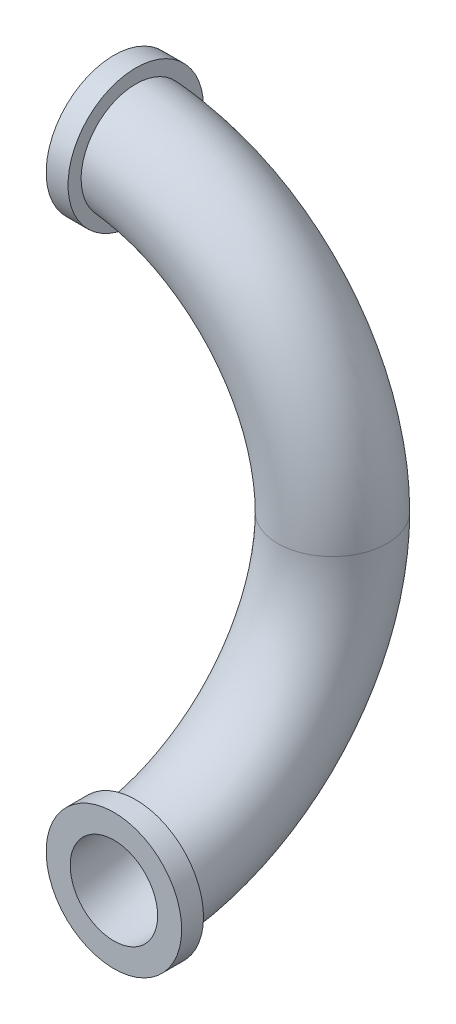
ISO-10303-21;
HEADER;
FILE_DESCRIPTION(('STEP AP214'),'2;1');
FILE_NAME('part.step','',(''),(''),'','','');
FILE_SCHEMA(('AUTOMOTIVE_DESIGN { 1 0 10303 214 1 1 1 1 }'));
ENDSEC;
DATA;
#1=APPLICATION_CONTEXT('core data for automotive mechanical design processes');
#2=APPLICATION_PROTOCOL_DEFINITION('international standard','automotive_design',2000,#1);
#3=PRODUCT_CONTEXT('',#1,'mechanical');
#4=PRODUCT('Part','Part','',(#3));
#5=PRODUCT_RELATED_PRODUCT_CATEGORY('part','',(#4));
#6=PRODUCT_DEFINITION_FORMATION('','',#4);
#7=PRODUCT_DEFINITION_CONTEXT('part definition',#1,'design');
#8=PRODUCT_DEFINITION('design','',#6,#7);
#9=PRODUCT_DEFINITION_SHAPE('','',#8);
#10=(LENGTH_UNIT() NAMED_UNIT(*) SI_UNIT(.MILLI.,.METRE.));
#11=(NAMED_UNIT(*) PLANE_ANGLE_UNIT() SI_UNIT($,.RADIAN.));
#12=(NAMED_UNIT(*) SI_UNIT($,.STERADIAN.) SOLID_ANGLE_UNIT());
#13=UNCERTAINTY_MEASURE_WITH_UNIT(LENGTH_MEASURE(1.E-05),#10,'distance_accuracy_value','');
#14=(GEOMETRIC_REPRESENTATION_CONTEXT(3) GLOBAL_UNCERTAINTY_ASSIGNED_CONTEXT((#13)) GLOBAL_UNIT_ASSIGNED_CONTEXT((#10,
#11,#12)) REPRESENTATION_CONTEXT('',''));
#15=CARTESIAN_POINT('',(0.,0.,0.));
#16=DIRECTION('',(0.,0.,1.));
#17=DIRECTION('',(1.,0.,0.));
#18=AXIS2_PLACEMENT_3D('',#15,#16,#17);
#19=CARTESIAN_POINT('',(0.,0.,1.));
#20=DIRECTION('',(-1.,0.,0.));
#21=DIRECTION('',(0.,0.,1.));
#22=AXIS2_PLACEMENT_3D('',#19,#20,#21);
#23=TOROIDAL_SURFACE('',#22,1.,0.25);
#24=CARTESIAN_POINT('',(0.,0.,0.));
#25=DIRECTION('',(0.,1.,0.));
#26=DIRECTION('',(0.,0.,1.));
#27=AXIS2_PLACEMENT_3D('',#24,#25,#26);
#28=CIRCLE('',#27,0.25);
#29=CARTESIAN_POINT('',(0.,0.,0.25));
#30=VERTEX_POINT('',#29);
#31=EDGE_CURVE('E10',#30,#30,#28,.F.);
#32=ORIENTED_EDGE('',*,*,#31,.T.);
#33=EDGE_LOOP('',(#32));
#34=FACE_BOUND('',#33,.T.);
#35=CARTESIAN_POINT('',(-0.178292636183617,-1.17098549054282,0.900000000000003));
#36=CARTESIAN_POINT('',(-0.1881607781353,-1.16090842808678,0.900000000000003));
#37=CARTESIAN_POINT('',(-0.197182692884507,-1.14998793195382,0.900000000000003));
#38=CARTESIAN_POINT('',(-0.213270077900997,-1.12677655508398,0.900000000000003));
#39=CARTESIAN_POINT('',(-0.22033309163346,-1.11448398054544,0.900000000000003));
#40=CARTESIAN_POINT('',(-0.232292866689927,-1.08889529204329,0.900000000000003));
#41=CARTESIAN_POINT('',(-0.237191034372383,-1.07559983617821,0.900000000000003));
#42=CARTESIAN_POINT('',(-0.244691584370048,-1.04838060332081,0.900000000000003));
#43=CARTESIAN_POINT('',(-0.247294534086588,-1.03445698251246,0.900000000000003));
#44=CARTESIAN_POINT('',(-0.250142452436041,-1.00632759492755,0.900000000000003));
#45=CARTESIAN_POINT('',(-0.250380189229146,-0.992121095819662,0.900000000000003));
#46=CARTESIAN_POINT('',(-0.248475214285631,-0.963867966938748,0.900000000000003));
#47=CARTESIAN_POINT('',(-0.246332355081699,-0.949821347123993,0.900000000000003));
#48=CARTESIAN_POINT('',(-0.239717413502975,-0.922241186252228,0.900000000000003));
#49=CARTESIAN_POINT('',(-0.235238091078439,-0.908709381110785,0.900000000000003));
#50=CARTESIAN_POINT('',(-0.224071976569553,-0.882589211894277,0.900000000000003));
#51=CARTESIAN_POINT('',(-0.217385165094366,-0.87000085610777,0.900000000000003));
#52=CARTESIAN_POINT('',(-0.201988642520699,-0.846124098833437,0.900000000000003));
#53=CARTESIAN_POINT('',(-0.193278440918038,-0.834836013547421,0.900000000000003));
#54=CARTESIAN_POINT('',(-0.17407922894507,-0.813889939376688,0.900000000000003));
#55=CARTESIAN_POINT('',(-0.163590251964975,-0.804231919900042,0.900000000000003));
#56=CARTESIAN_POINT('',(-0.141176479164212,-0.786867241939183,0.900000000000003));
#57=CARTESIAN_POINT('',(-0.129257971249421,-0.779152469253919,0.900000000000003));
#58=CARTESIAN_POINT('',(-0.104287031962781,-0.765851473076845,0.900000000000003));
#59=CARTESIAN_POINT('',(-0.0912346526586706,-0.76026515190924,0.900000000000003));
#60=CARTESIAN_POINT('',(-0.0644742428118953,-0.751425460421924,0.900000000000003));
#61=CARTESIAN_POINT('',(-0.050772048519749,-0.748154421249714,0.900000000000003));
#62=CARTESIAN_POINT('',(-0.023012077929381,-0.743975651296628,0.900000000000003));
#63=CARTESIAN_POINT('',(-0.00895431749171269,-0.743067815288643,0.900000000000003));
#64=CARTESIAN_POINT('',(0.0190228492591987,-0.74364135058969,0.900000000000003));
#65=CARTESIAN_POINT('',(0.0329425678616444,-0.745107621808641,0.900000000000003));
#66=CARTESIAN_POINT('',(0.0603380179178707,-0.750356198928883,0.900000000000003));
#67=CARTESIAN_POINT('',(0.073813751350267,-0.754138494507361,0.900000000000003));
#68=CARTESIAN_POINT('',(0.0999438190310865,-0.763906156922004,0.900000000000003));
#69=CARTESIAN_POINT('',(0.112598007726036,-0.769891912900078,0.900000000000003));
#70=CARTESIAN_POINT('',(0.136730876432484,-0.783889666200691,0.900000000000003));
#71=CARTESIAN_POINT('',(0.148209518516286,-0.791901728870833,0.900000000000003));
#72=CARTESIAN_POINT('',(0.169746255988988,-0.809778700852076,0.900000000000003));
#73=CARTESIAN_POINT('',(0.179794652113536,-0.81965529369633,0.900000000000003));
#74=CARTESIAN_POINT('',(0.19810623248561,-0.840943976249636,0.900000000000003));
#75=CARTESIAN_POINT('',(0.20636934276824,-0.852356129545618,0.900000000000003));
#76=CARTESIAN_POINT('',(0.220940331071125,-0.876486355486264,0.900000000000003));
#77=CARTESIAN_POINT('',(0.227232825912157,-0.889213719053285,0.900000000000003));
#78=CARTESIAN_POINT('',(0.237602040803077,-0.91554122766997,0.900000000000003));
#79=CARTESIAN_POINT('',(0.241678703230035,-0.929141395406706,0.900000000000003));
#80=CARTESIAN_POINT('',(0.247514080437859,-0.956889464003895,0.900000000000003));
#81=CARTESIAN_POINT('',(0.249263112362012,-0.971039402463742,0.900000000000003));
#82=CARTESIAN_POINT('',(0.250360209116889,-0.999432198204243,0.900000000000003));
#83=CARTESIAN_POINT('',(0.249708265447999,-1.01367505581366,0.900000000000003));
#84=CARTESIAN_POINT('',(0.246018978923066,-1.04184448636228,0.900000000000003));
#85=CARTESIAN_POINT('',(0.242982318470242,-1.05577114861014,0.900000000000003));
#86=CARTESIAN_POINT('',(0.234606556433797,-1.08291410811893,0.900000000000003));
#87=CARTESIAN_POINT('',(0.229267489324382,-1.09613041601276,0.900000000000003));
#88=CARTESIAN_POINT('',(0.21645555868548,-1.12143232220934,0.900000000000003));
#89=CARTESIAN_POINT('',(0.208989494520124,-1.1335213631535,0.900000000000003));
#90=CARTESIAN_POINT('',(0.192125980388275,-1.15626771424003,0.900000000000003));
#91=CARTESIAN_POINT('',(0.182728567012736,-1.16692505150084,0.900000000000003));
#92=CARTESIAN_POINT('',(0.162310005604278,-1.18645975330621,0.900000000000003));
#93=CARTESIAN_POINT('',(0.151295570919789,-1.19534413507507,0.900000000000003));
#94=CARTESIAN_POINT('',(0.127927087453048,-1.21112992028928,0.900000000000003));
#95=CARTESIAN_POINT('',(0.115573062265724,-1.21803135865347,0.900000000000003));
#96=CARTESIAN_POINT('',(0.0899224071837983,-1.22963088974639,0.900000000000003));
#97=CARTESIAN_POINT('',(0.0766291957724238,-1.23433654266105,0.900000000000003));
#98=CARTESIAN_POINT('',(0.0494410215956045,-1.24144365913665,0.900000000000003));
#99=CARTESIAN_POINT('',(0.0355460909861572,-1.24384524566895,0.900000000000003));
#100=CARTESIAN_POINT('',(0.00758219264240244,-1.24627239605983,0.900000000000003));
#101=CARTESIAN_POINT('',(-0.00648630877070629,-1.24630333770059,0.900000000000003));
#102=CARTESIAN_POINT('',(-0.0344323772539546,-1.24400127304341,0.900000000000003));
#103=CARTESIAN_POINT('',(-0.0483098967728788,-1.24166768843868,0.900000000000003));
#104=CARTESIAN_POINT('',(-0.0754744153645764,-1.23470428803997,0.900000000000003));
#105=CARTESIAN_POINT('',(-0.0887614308145444,-1.23007453597187,0.900000000000003));
#106=CARTESIAN_POINT('',(-0.114358765464973,-1.21865465943775,0.900000000000003));
#107=CARTESIAN_POINT('',(-0.126670245369808,-1.21186715201986,0.900000000000003));
#108=CARTESIAN_POINT('',(-0.145533828532969,-1.19929605354006,0.900000000000003));
#109=CARTESIAN_POINT('',(-0.152494362008292,-1.1941138072033,0.900000000000003));
#110=CARTESIAN_POINT('',(-0.165840730528643,-1.18305577365907,0.900000000000003));
#111=CARTESIAN_POINT('',(-0.172226565912627,-1.17717998686064,0.900000000000003));
#112=CARTESIAN_POINT('',(-0.178292636183617,-1.17098549054282,0.900000000000003));
#113=B_SPLINE_CURVE_WITH_KNOTS('',3,(#35,#36,#37,#38,#39,#40,#41,#42,#43,#44,#45,#46,#47,#48,
#49,#50,#51,#52,#53,#54,#55,#56,#57,#58,#59,#60,#61,#62,#63,#64,#65,#66,#67,#68,#69,#70,#71,#72,
#73,#74,#75,#76,#77,#78,#79,#80,#81,#82,#83,#84,#85,#86,#87,#88,#89,#90,#91,#92,#93,#94,#95,#96,
#97,#98,#99,#100,#101,#102,#103,#104,#105,#106,#107,#108,#109,#110,#111,#112),.UNSPECIFIED.,.T.,
.F.,(4,2,2,2,2,2,2,2,2,2,2,2,2,2,2,2,2,2,2,2,2,2,2,2,2,2,2,2,2,2,2,2,2,2,2,2,2,2,4),(0.,
0.0422806841704309,0.0846141525906926,0.126920079165117,0.169215544347814,0.211640291915797,
0.254067667654334,0.296627301989538,0.339187310183432,0.381757646433651,0.424327183664881,
0.466715905920491,0.509102682700278,0.551162395665215,0.59322023579173,0.635011623666279,
0.676802825272704,0.718601410953791,0.760401344794948,0.802472465255508,0.844545328400345,
0.886938878074265,0.92933353014368,0.971903996782705,1.01447461412419,1.05703305402574,
1.09959085671686,1.14201411286897,1.1844365653527,1.22668762914184,1.26893794886109,
1.31104170552296,1.3531432149214,1.39514921466858,1.43716549056303,1.47918060043894,
1.52114494518385,1.54713542584479,1.57312589117647),.UNSPECIFIED.);
#114=CARTESIAN_POINT('',(-0.178292636183617,-1.17098549054282,0.900000000000003));
#115=VERTEX_POINT('',#114);
#116=EDGE_CURVE('E49',#115,#115,#113,.T.);
#117=ORIENTED_EDGE('',*,*,#116,.T.);
#118=EDGE_LOOP('',(#117));
#119=FACE_BOUND('',#118,.T.);
#120=ADVANCED_FACE('F30',(#34,#119),#23,.T.);
#121=CARTESIAN_POINT('',(-1.,0.,0.));
#122=DIRECTION('',(0.,0.,1.));
#123=DIRECTION('',(1.,0.,0.));
#124=AXIS2_PLACEMENT_3D('',#121,#122,#123);
#125=TOROIDAL_SURFACE('',#124,1.,0.25);
#126=CARTESIAN_POINT('',(-0.900000000000003,0.798598903682392,-0.156239637939055));
#127=CARTESIAN_POINT('',(-0.900000000000003,0.807484618255236,-0.167252077609579));
#128=CARTESIAN_POINT('',(-0.900000000000003,0.817311544826018,-0.177518916216291));
#129=CARTESIAN_POINT('',(-0.900000000000003,0.838559793603693,-0.196263733860563));
#130=CARTESIAN_POINT('',(-0.900000000000003,0.849983168244315,-0.204739374280309));
#131=CARTESIAN_POINT('',(-0.900000000000003,0.874081969106657,-0.21965059164289));
#132=CARTESIAN_POINT('',(-0.900000000000003,0.886756519343002,-0.226087582802604));
#133=CARTESIAN_POINT('',(-0.900000000000003,0.91300023448786,-0.236747922206686));
#134=CARTESIAN_POINT('',(-0.900000000000003,0.926569163740225,-0.240971850957424));
#135=CARTESIAN_POINT('',(-0.900000000000003,0.954266098089081,-0.247100376432861));
#136=CARTESIAN_POINT('',(-0.900000000000003,0.968395725822489,-0.248997644239264));
#137=CARTESIAN_POINT('',(-0.900000000000003,0.996773707944956,-0.25039290443244));
#138=CARTESIAN_POINT('',(-0.900000000000003,1.01102206788375,-0.249890784032819));
#139=CARTESIAN_POINT('',(-0.900000000000003,1.03922913334701,-0.246498215551317));
#140=CARTESIAN_POINT('',(-0.900000000000003,1.0531878915475,-0.243608205779841));
#141=CARTESIAN_POINT('',(-0.900000000000003,1.08041932555232,-0.235518387044002));
#142=CARTESIAN_POINT('',(-0.900000000000003,1.09369201220856,-0.230318614626673));
#143=CARTESIAN_POINT('',(-0.900000000000003,1.11913001861259,-0.2177730971395));
#144=CARTESIAN_POINT('',(-0.900000000000003,1.13129864492456,-0.210434057268884));
#145=CARTESIAN_POINT('',(-0.900000000000003,1.15422440361082,-0.19380938875738));
#146=CARTESIAN_POINT('',(-0.900000000000003,1.16498156794405,-0.184523804203367));
#147=CARTESIAN_POINT('',(-0.900000000000003,1.18473296660521,-0.164309957154078));
#148=CARTESIAN_POINT('',(-0.900000000000003,1.19373414042714,-0.153388475286226));
#149=CARTESIAN_POINT('',(-0.900000000000003,1.20976742880129,-0.130184858647995));
#150=CARTESIAN_POINT('',(-0.900000000000003,1.2167995799634,-0.117902749181585));
#151=CARTESIAN_POINT('',(-0.900000000000003,1.22866989147601,-0.0923732303855616));
#152=CARTESIAN_POINT('',(-0.900000000000003,1.23351568693935,-0.0791293707956552));
#153=CARTESIAN_POINT('',(-0.900000000000003,1.24090948117469,-0.0520150874536931));
#154=CARTESIAN_POINT('',(-0.900000000000003,1.24345751315272,-0.0381446727593144));
#155=CARTESIAN_POINT('',(-0.900000000000003,1.24617903253143,-0.0102038849674368));
#156=CARTESIAN_POINT('',(-0.900000000000003,1.24635775803878,0.00386597816705005));
#157=CARTESIAN_POINT('',(-0.900000000000003,1.2443490557881,0.0318357092211724));
#158=CARTESIAN_POINT('',(-0.900000000000003,1.24216164206245,0.0457355781484645));
#159=CARTESIAN_POINT('',(-0.900000000000003,1.23548566564956,0.0729628531749478));
#160=CARTESIAN_POINT('',(-0.900000000000003,1.23099839651049,0.0862905765141687));
#161=CARTESIAN_POINT('',(-0.900000000000003,1.21985250641525,0.112004722408348));
#162=CARTESIAN_POINT('',(-0.900000000000003,1.2131938798134,0.124391142515752));
#163=CARTESIAN_POINT('',(-0.900000000000003,1.19788731542389,0.147887218294668));
#164=CARTESIAN_POINT('',(-0.900000000000003,1.18923708938565,0.158995383124042));
#165=CARTESIAN_POINT('',(-0.900000000000003,1.17019911655826,0.179606640126357));
#166=CARTESIAN_POINT('',(-0.900000000000003,1.15981135014478,0.189109714168458));
#167=CARTESIAN_POINT('',(-0.900000000000003,1.13756371948689,0.206269460174094));
#168=CARTESIAN_POINT('',(-0.900000000000003,1.1256999380033,0.213921053042685));
#169=CARTESIAN_POINT('',(-0.900000000000003,1.1008600065118,0.227132541762657));
#170=CARTESIAN_POINT('',(-0.900000000000003,1.08788383586549,0.232692398795301));
#171=CARTESIAN_POINT('',(-0.900000000000003,1.06113487356717,0.241585432017897));
#172=CARTESIAN_POINT('',(-0.900000000000003,1.04735924079537,0.24491006219374));
#173=CARTESIAN_POINT('',(-0.900000000000003,1.01944604647422,0.249209299271431));
#174=CARTESIAN_POINT('',(-0.900000000000003,1.00530847649482,0.250183851386031));
#175=CARTESIAN_POINT('',(-0.900000000000003,0.977013676572304,0.249758171980877));
#176=CARTESIAN_POINT('',(-0.900000000000003,0.962856586441288,0.248348625861424));
#177=CARTESIAN_POINT('',(-0.900000000000003,0.934978226305415,0.243178774257247));
#178=CARTESIAN_POINT('',(-0.900000000000003,0.92125696445682,0.239418424805864));
#179=CARTESIAN_POINT('',(-0.900000000000003,0.894606137350387,0.229641253917731));
#180=CARTESIAN_POINT('',(-0.900000000000003,0.88167853001149,0.223619093935772));
#181=CARTESIAN_POINT('',(-0.900000000000003,0.857019113242033,0.209487505095425));
#182=CARTESIAN_POINT('',(-0.900000000000003,0.845287309521206,0.20137806627133));
#183=CARTESIAN_POINT('',(-0.900000000000003,0.82337073898221,0.183309172670559));
#184=CARTESIAN_POINT('',(-0.900000000000003,0.813184120587848,0.173351964393591));
#185=CARTESIAN_POINT('',(-0.900000000000003,0.794638704052554,0.15185994909619));
#186=CARTESIAN_POINT('',(-0.900000000000003,0.78627985742117,0.140325183941254));
#187=CARTESIAN_POINT('',(-0.900000000000003,0.771681279589619,0.116074864617453));
#188=CARTESIAN_POINT('',(-0.900000000000003,0.765429652543109,0.10336647310674));
#189=CARTESIAN_POINT('',(-0.900000000000003,0.755168543349376,0.0770751991823281));
#190=CARTESIAN_POINT('',(-0.900000000000003,0.751158856651886,0.0634923966743233));
#191=CARTESIAN_POINT('',(-0.900000000000003,0.745526882823232,0.0359545442264938));
#192=CARTESIAN_POINT('',(-0.900000000000003,0.743885669678652,0.0220033627581732));
#193=CARTESIAN_POINT('',(-0.900000000000003,0.74298034692899,-0.00597955267888296));
#194=CARTESIAN_POINT('',(-0.900000000000003,0.743716757423659,-0.0200113036018257));
#195=CARTESIAN_POINT('',(-0.900000000000003,0.74753647692591,-0.0476924426774215));
#196=CARTESIAN_POINT('',(-0.900000000000003,0.750610365346218,-0.0613431382070536));
#197=CARTESIAN_POINT('',(-0.900000000000003,0.758999581108099,-0.0879247327922058));
#198=CARTESIAN_POINT('',(-0.900000000000003,0.764312213341436,-0.100856476238292));
#199=CARTESIAN_POINT('',(-0.900000000000003,0.774564130392535,-0.120867695525504));
#200=CARTESIAN_POINT('',(-0.900000000000003,0.778860177938197,-0.128284026486041));
#201=CARTESIAN_POINT('',(-0.900000000000003,0.788188886205849,-0.142637803870627));
#202=CARTESIAN_POINT('',(-0.900000000000003,0.793221545166893,-0.149575251439439));
#203=CARTESIAN_POINT('',(-0.900000000000003,0.798598903682392,-0.156239637939055));
#204=B_SPLINE_CURVE_WITH_KNOTS('',3,(#126,#127,#128,#129,#130,#131,#132,#133,#134,#135,#136,
#137,#138,#139,#140,#141,#142,#143,#144,#145,#146,#147,#148,#149,#150,#151,#152,#153,#154,#155,
#156,#157,#158,#159,#160,#161,#162,#163,#164,#165,#166,#167,#168,#169,#170,#171,#172,#173,#174,
#175,#176,#177,#178,#179,#180,#181,#182,#183,#184,#185,#186,#187,#188,#189,#190,#191,#192,#193,
#194,#195,#196,#197,#198,#199,#200,#201,#202,#203),.UNSPECIFIED.,.T.,.F.,(4,2,2,2,2,2,2,2,2,2,2,
2,2,2,2,2,2,2,2,2,2,2,2,2,2,2,2,2,2,2,2,2,2,2,2,2,2,2,4),(0.,0.0424192772184809,
0.0848936001837859,0.127338393721263,0.16977204802275,0.21233902665477,0.254908006223218,
0.297469173753552,0.340029667868764,0.382458171419216,0.424885714119334,0.467142031024321,
0.509397562208715,0.551504365817851,0.593610560912517,0.635623651286503,0.677636492503143,
0.719625729586843,0.761615075846239,0.803652908716627,0.845691216407668,0.88784357092604,
0.929996707675384,0.97231010702195,1.01462449280908,1.05710458176961,1.09958546525149,
1.14216725288102,1.18474924382094,1.22727979920904,1.26980922613231,1.3120943759003,
1.35437566702383,1.39631718923709,1.43826788668425,1.48005040315259,1.52178276285504,
1.54745365347394,1.57312448272488),.UNSPECIFIED.);
#205=CARTESIAN_POINT('',(-0.900000000000003,0.798598903682392,-0.156239637939055));
#206=VERTEX_POINT('',#205);
#207=EDGE_CURVE('E34',#206,#206,#204,.T.);
#208=ORIENTED_EDGE('',*,*,#207,.T.);
#209=EDGE_LOOP('',(#208));
#210=FACE_BOUND('',#209,.T.);
#211=ORIENTED_EDGE('',*,*,#31,.F.);
#212=EDGE_LOOP('',(#211));
#213=FACE_BOUND('',#212,.T.);
#214=ADVANCED_FACE('F82',(#210,#213),#125,.T.);
#215=CARTESIAN_POINT('',(-1.,1.,0.));
#216=DIRECTION('',(1.,0.,0.));
#217=DIRECTION('',(0.,1.,0.));
#218=AXIS2_PLACEMENT_3D('',#215,#216,#217);
#219=PLANE('',#218);
#220=CARTESIAN_POINT('',(-1.,1.,0.));
#221=DIRECTION('',(1.,0.,0.));
#222=DIRECTION('',(0.,1.,0.));
#223=AXIS2_PLACEMENT_3D('',#220,#221,#222);
#224=CIRCLE('',#223,0.2);
#225=CARTESIAN_POINT('',(-1.,1.2,0.));
#226=VERTEX_POINT('',#225);
#227=EDGE_CURVE('E41',#226,#226,#224,.T.);
#228=ORIENTED_EDGE('',*,*,#227,.T.);
#229=EDGE_LOOP('',(#228));
#230=FACE_BOUND('',#229,.T.);
#231=CARTESIAN_POINT('',(-1.,1.,0.));
#232=DIRECTION('',(1.,0.,0.));
#233=DIRECTION('',(0.,0.,-1.));
#234=AXIS2_PLACEMENT_3D('',#231,#232,#233);
#235=CIRCLE('',#234,0.31);
#236=CARTESIAN_POINT('',(-1.,1.,-0.31));
#237=VERTEX_POINT('',#236);
#238=EDGE_CURVE('E99',#237,#237,#235,.T.);
#239=ORIENTED_EDGE('',*,*,#238,.F.);
#240=EDGE_LOOP('',(#239));
#241=FACE_BOUND('',#240,.T.);
#242=ADVANCED_FACE('F79',(#230,#241),#219,.F.);
#243=CARTESIAN_POINT('',(0.,-1.,1.));
#244=DIRECTION('',(0.,0.,1.));
#245=DIRECTION('',(1.,0.,0.));
#246=AXIS2_PLACEMENT_3D('',#243,#244,#245);
#247=PLANE('',#246);
#248=CARTESIAN_POINT('',(0.,-1.,1.));
#249=DIRECTION('',(0.,0.,1.));
#250=DIRECTION('',(1.,0.,0.));
#251=AXIS2_PLACEMENT_3D('',#248,#249,#250);
#252=CIRCLE('',#251,0.2);
#253=CARTESIAN_POINT('',(0.2,-1.,1.));
#254=VERTEX_POINT('',#253);
#255=EDGE_CURVE('E54',#254,#254,#252,.T.);
#256=ORIENTED_EDGE('',*,*,#255,.F.);
#257=EDGE_LOOP('',(#256));
#258=FACE_BOUND('',#257,.T.);
#259=CARTESIAN_POINT('',(0.,-1.,1.));
#260=DIRECTION('',(0.,0.,1.));
#261=DIRECTION('',(1.,0.,0.));
#262=AXIS2_PLACEMENT_3D('',#259,#260,#261);
#263=CIRCLE('',#262,0.31);
#264=CARTESIAN_POINT('',(0.31,-1.,1.));
#265=VERTEX_POINT('',#264);
#266=EDGE_CURVE('E94',#265,#265,#263,.T.);
#267=ORIENTED_EDGE('',*,*,#266,.T.);
#268=EDGE_LOOP('',(#267));
#269=FACE_BOUND('',#268,.T.);
#270=ADVANCED_FACE('F75',(#258,#269),#247,.T.);
#271=CARTESIAN_POINT('',(-1.,0.,0.));
#272=DIRECTION('',(0.,0.,1.));
#273=DIRECTION('',(1.,0.,0.));
#274=AXIS2_PLACEMENT_3D('',#271,#272,#273);
#275=TOROIDAL_SURFACE('',#274,1.,0.2);
#276=CARTESIAN_POINT('',(0.,0.,0.));
#277=DIRECTION('',(0.,-1.,0.));
#278=DIRECTION('',(1.,0.,0.));
#279=AXIS2_PLACEMENT_3D('',#276,#277,#278);
#280=CIRCLE('',#279,0.2);
#281=CARTESIAN_POINT('',(0.2,0.,0.));
#282=VERTEX_POINT('',#281);
#283=EDGE_CURVE('E46',#282,#282,#280,.T.);
#284=CARTESIAN_POINT('',(-1.,0.,0.));
#285=DIRECTION('',(0.,0.,1.));
#286=DIRECTION('',(1.,0.,0.));
#287=AXIS2_PLACEMENT_3D('',#284,#285,#286);
#288=CIRCLE('',#287,1.2);
#289=EDGE_CURVE('',#282,#226,#288,.T.);
#290=ORIENTED_EDGE('',*,*,#283,.T.);
#291=ORIENTED_EDGE('',*,*,#227,.F.);
#292=ORIENTED_EDGE('',*,*,#289,.T.);
#293=ORIENTED_EDGE('',*,*,#289,.F.);
#294=EDGE_LOOP('',(#290,#292,#291,#293));
#295=FACE_BOUND('',#294,.T.);
#296=ADVANCED_FACE('F71',(#295),#275,.F.);
#297=CARTESIAN_POINT('',(0.,0.,1.));
#298=DIRECTION('',(-1.,0.,0.));
#299=DIRECTION('',(0.,0.,1.));
#300=AXIS2_PLACEMENT_3D('',#297,#298,#299);
#301=TOROIDAL_SURFACE('',#300,1.,0.2);
#302=ORIENTED_EDGE('',*,*,#283,.F.);
#303=EDGE_LOOP('',(#302));
#304=FACE_BOUND('',#303,.T.);
#305=ORIENTED_EDGE('',*,*,#255,.T.);
#306=EDGE_LOOP('',(#305));
#307=FACE_BOUND('',#306,.T.);
#308=ADVANCED_FACE('F67',(#304,#307),#301,.F.);
#309=CARTESIAN_POINT('',(0.,-1.,0.900000000000003));
#310=DIRECTION('',(0.,0.,1.));
#311=DIRECTION('',(1.,0.,0.));
#312=AXIS2_PLACEMENT_3D('',#309,#310,#311);
#313=CYLINDRICAL_SURFACE('',#312,0.31);
#314=CARTESIAN_POINT('',(0.,-1.,0.900000000000003));
#315=DIRECTION('',(0.,0.,1.));
#316=DIRECTION('',(1.,0.,0.));
#317=AXIS2_PLACEMENT_3D('',#314,#315,#316);
#318=CIRCLE('',#317,0.31);
#319=CARTESIAN_POINT('',(0.31,-1.,0.900000000000003));
#320=VERTEX_POINT('',#319);
#321=EDGE_CURVE('E55',#320,#320,#318,.T.);
#322=ORIENTED_EDGE('',*,*,#321,.T.);
#323=EDGE_LOOP('',(#322));
#324=FACE_BOUND('',#323,.T.);
#325=ORIENTED_EDGE('',*,*,#266,.F.);
#326=EDGE_LOOP('',(#325));
#327=FACE_BOUND('',#326,.T.);
#328=ADVANCED_FACE('F62',(#324,#327),#313,.T.);
#329=CARTESIAN_POINT('',(0.,-1.,0.900000000000003));
#330=DIRECTION('',(0.,0.,1.));
#331=DIRECTION('',(1.,0.,0.));
#332=AXIS2_PLACEMENT_3D('',#329,#330,#331);
#333=PLANE('',#332);
#334=ORIENTED_EDGE('',*,*,#116,.F.);
#335=EDGE_LOOP('',(#334));
#336=FACE_BOUND('',#335,.T.);
#337=ORIENTED_EDGE('',*,*,#321,.F.);
#338=EDGE_LOOP('',(#337));
#339=FACE_BOUND('',#338,.T.);
#340=ADVANCED_FACE('F56',(#336,#339),#333,.F.);
#341=CARTESIAN_POINT('',(-0.900000000000003,1.,0.));
#342=DIRECTION('',(1.,0.,0.));
#343=DIRECTION('',(0.,0.,-1.));
#344=AXIS2_PLACEMENT_3D('',#341,#342,#343);
#345=PLANE('',#344);
#346=CARTESIAN_POINT('',(-0.900000000000003,1.,0.));
#347=DIRECTION('',(1.,0.,0.));
#348=DIRECTION('',(0.,0.,-1.));
#349=AXIS2_PLACEMENT_3D('',#346,#347,#348);
#350=CIRCLE('',#349,0.31);
#351=CARTESIAN_POINT('',(-0.900000000000003,1.,-0.31));
#352=VERTEX_POINT('',#351);
#353=EDGE_CURVE('E95',#352,#352,#350,.T.);
#354=ORIENTED_EDGE('',*,*,#353,.T.);
#355=EDGE_LOOP('',(#354));
#356=FACE_BOUND('',#355,.T.);
#357=ORIENTED_EDGE('',*,*,#207,.F.);
#358=EDGE_LOOP('',(#357));
#359=FACE_BOUND('',#358,.T.);
#360=ADVANCED_FACE('F61',(#356,#359),#345,.T.);
#361=CARTESIAN_POINT('',(-0.900000000000003,1.,0.));
#362=DIRECTION('',(-1.,0.,0.));
#363=DIRECTION('',(0.,0.,1.));
#364=AXIS2_PLACEMENT_3D('',#361,#362,#363);
#365=CYLINDRICAL_SURFACE('',#364,0.31);
#366=ORIENTED_EDGE('',*,*,#353,.F.);
#367=EDGE_LOOP('',(#366));
#368=FACE_BOUND('',#367,.T.);
#369=ORIENTED_EDGE('',*,*,#238,.T.);
#370=EDGE_LOOP('',(#369));
#371=FACE_BOUND('',#370,.T.);
#372=ADVANCED_FACE('F64',(#368,#371),#365,.T.);
#373=CLOSED_SHELL('',(#120,#214,#242,#270,#296,#308,#328,#340,#360,#372));
#374=MANIFOLD_SOLID_BREP('B2',#373);
#375=ADVANCED_BREP_SHAPE_REPRESENTATION('',(#18,#374),#14);
#376=SHAPE_DEFINITION_REPRESENTATION(#9,#375);
ENDSEC;
END-ISO-10303-21;
